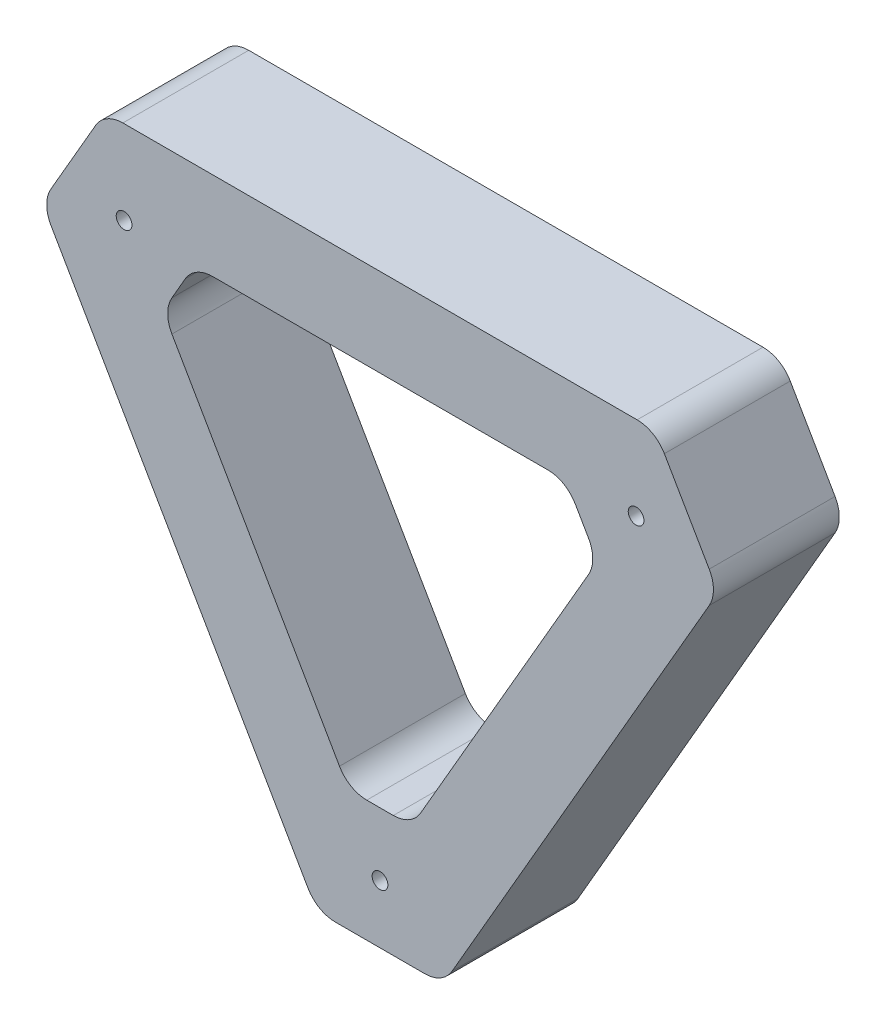
ISO-10303-21;
HEADER;
FILE_DESCRIPTION(('STEP AP214'),'2;1');
FILE_NAME('part.step','',(''),(''),'','','');
FILE_SCHEMA(('AUTOMOTIVE_DESIGN { 1 0 10303 214 1 1 1 1 }'));
ENDSEC;
DATA;
#1=APPLICATION_CONTEXT('core data for automotive mechanical design processes');
#2=APPLICATION_PROTOCOL_DEFINITION('international standard','automotive_design',2000,#1);
#3=PRODUCT_CONTEXT('',#1,'mechanical');
#4=PRODUCT('Part','Part','',(#3));
#5=PRODUCT_RELATED_PRODUCT_CATEGORY('part','',(#4));
#6=PRODUCT_DEFINITION_FORMATION('','',#4);
#7=PRODUCT_DEFINITION_CONTEXT('part definition',#1,'design');
#8=PRODUCT_DEFINITION('design','',#6,#7);
#9=PRODUCT_DEFINITION_SHAPE('','',#8);
#10=(LENGTH_UNIT() NAMED_UNIT(*) SI_UNIT(.MILLI.,.METRE.));
#11=(NAMED_UNIT(*) PLANE_ANGLE_UNIT() SI_UNIT($,.RADIAN.));
#12=(NAMED_UNIT(*) SI_UNIT($,.STERADIAN.) SOLID_ANGLE_UNIT());
#13=UNCERTAINTY_MEASURE_WITH_UNIT(LENGTH_MEASURE(1.E-05),#10,'distance_accuracy_value','');
#14=(GEOMETRIC_REPRESENTATION_CONTEXT(3) GLOBAL_UNCERTAINTY_ASSIGNED_CONTEXT((#13)) GLOBAL_UNIT_ASSIGNED_CONTEXT((#10,
#11,#12)) REPRESENTATION_CONTEXT('',''));
#15=CARTESIAN_POINT('',(0.,0.,0.));
#16=DIRECTION('',(0.,0.,1.));
#17=DIRECTION('',(1.,0.,0.));
#18=AXIS2_PLACEMENT_3D('',#15,#16,#17);
#19=CARTESIAN_POINT('',(71.1053170988695,110.713631436787,20.));
#20=DIRECTION('',(0.,0.,1.));
#21=DIRECTION('',(1.,0.,0.));
#22=AXIS2_PLACEMENT_3D('',#19,#20,#21);
#23=PLANE('',#22);
#24=CARTESIAN_POINT('',(63.9917018959607,114.980441868389,20.));
#25=DIRECTION('',(0.,0.,1.));
#26=DIRECTION('',(1.,0.,0.));
#27=AXIS2_PLACEMENT_3D('',#24,#25,#26);
#28=CIRCLE('',#27,1.25);
#29=CARTESIAN_POINT('',(65.2417018959607,114.980441868389,20.));
#30=VERTEX_POINT('',#29);
#31=EDGE_CURVE('E699',#30,#30,#28,.T.);
#32=ORIENTED_EDGE('',*,*,#31,.F.);
#33=EDGE_LOOP('',(#32));
#34=FACE_BOUND('',#33,.T.);
#35=DIRECTION('',(1.,0.,0.));
#36=VECTOR('',#35,1.);
#37=CARTESIAN_POINT('',(61.8848779374495,124.993254081832,20.));
#38=LINE('',#37,#36);
#39=CARTESIAN_POINT('',(61.8848779374495,124.993254081832,20.));
#40=VERTEX_POINT('',#39);
#41=CARTESIAN_POINT('',(66.1118188221357,124.993254081832,20.));
#42=VERTEX_POINT('',#41);
#43=EDGE_CURVE('E202',#40,#42,#38,.T.);
#44=ORIENTED_EDGE('',*,*,#43,.F.);
#45=CARTESIAN_POINT('',(61.8848779374495,129.993254081832,20.));
#46=DIRECTION('',(0.,0.,1.));
#47=DIRECTION('',(1.,0.,0.));
#48=AXIS2_PLACEMENT_3D('',#45,#46,#47);
#49=CIRCLE('',#48,5.);
#50=CARTESIAN_POINT('',(57.5538812574324,127.494760984447,20.));
#51=VERTEX_POINT('',#50);
#52=EDGE_CURVE('E194',#51,#40,#49,.T.);
#53=ORIENTED_EDGE('',*,*,#52,.F.);
#54=DIRECTION('',(0.499698619476988,-0.866199336003435,0.));
#55=VECTOR('',#54,1.);
#56=CARTESIAN_POINT('',(30.9258291216338,173.652985522339,20.));
#57=LINE('',#56,#55);
#58=CARTESIAN_POINT('',(30.9258291216338,173.652985522339,20.));
#59=VERTEX_POINT('',#58);
#60=EDGE_CURVE('E237',#59,#51,#57,.T.);
#61=ORIENTED_EDGE('',*,*,#60,.F.);
#62=CARTESIAN_POINT('',(35.256825801651,176.151478619724,20.));
#63=DIRECTION('',(0.,0.,1.));
#64=DIRECTION('',(1.,0.,0.));
#65=AXIS2_PLACEMENT_3D('',#62,#63,#64);
#66=CIRCLE('',#65,4.99999999999999);
#67=CARTESIAN_POINT('',(30.9268070179789,178.651666079305,20.));
#68=VERTEX_POINT('',#67);
#69=EDGE_CURVE('E235',#68,#59,#66,.T.);
#70=ORIENTED_EDGE('',*,*,#69,.F.);
#71=DIRECTION('',(-0.500037491916198,-0.866003756734437,0.));
#72=VECTOR('',#71,1.);
#73=CARTESIAN_POINT('',(30.9268070179789,178.651666079305,20.));
#74=LINE('',#73,#72);
#75=CARTESIAN_POINT('',(33.0411886245935,182.313516328736,20.));
#76=VERTEX_POINT('',#75);
#77=EDGE_CURVE('E233',#76,#68,#74,.T.);
#78=ORIENTED_EDGE('',*,*,#77,.F.);
#79=CARTESIAN_POINT('',(37.3712074082656,179.813328869155,20.));
#80=DIRECTION('',(0.,0.,1.));
#81=DIRECTION('',(1.,0.,0.));
#82=AXIS2_PLACEMENT_3D('',#79,#80,#81);
#83=CIRCLE('',#82,4.99999999999998);
#84=CARTESIAN_POINT('',(37.3700237476384,184.81332872905,20.));
#85=VERTEX_POINT('',#84);
#86=EDGE_CURVE('E231',#85,#76,#83,.T.);
#87=ORIENTED_EDGE('',*,*,#86,.F.);
#88=DIRECTION('',(-0.99999997197895,-0.000236732125444427,0.));
#89=VECTOR('',#88,1.);
#90=CARTESIAN_POINT('',(90.6853210420853,184.825950173051,20.));
#91=LINE('',#90,#89);
#92=CARTESIAN_POINT('',(90.6853210420853,184.825950173051,20.));
#93=VERTEX_POINT('',#92);
#94=EDGE_CURVE('E229',#93,#85,#91,.T.);
#95=ORIENTED_EDGE('',*,*,#94,.F.);
#96=CARTESIAN_POINT('',(90.6865047027125,179.825950313156,20.));
#97=DIRECTION('',(0.,0.,1.));
#98=DIRECTION('',(1.,0.,0.));
#99=AXIS2_PLACEMENT_3D('',#96,#97,#98);
#100=CIRCLE('',#99,5.);
#101=CARTESIAN_POINT('',(95.0148219172484,182.329082369272,20.));
#102=VERTEX_POINT('',#101);
#103=EDGE_CURVE('E227',#102,#93,#100,.T.);
#104=ORIENTED_EDGE('',*,*,#103,.F.);
#105=DIRECTION('',(-0.50062641122309,0.865663442907166,0.));
#106=VECTOR('',#105,1.);
#107=CARTESIAN_POINT('',(97.129519323786,178.672431028848,20.));
#108=LINE('',#107,#106);
#109=CARTESIAN_POINT('',(97.129519323786,178.672431028848,20.));
#110=VERTEX_POINT('',#109);
#111=EDGE_CURVE('E225',#110,#102,#108,.T.);
#112=ORIENTED_EDGE('',*,*,#111,.F.);
#113=CARTESIAN_POINT('',(92.8012021092502,176.169298972733,20.));
#114=DIRECTION('',(0.,0.,1.));
#115=DIRECTION('',(1.,0.,0.));
#116=AXIS2_PLACEMENT_3D('',#113,#114,#115);
#117=CIRCLE('',#116,5.);
#118=CARTESIAN_POINT('',(97.130125766881,173.667215847334,20.));
#119=VERTEX_POINT('',#118);
#120=EDGE_CURVE('E223',#119,#110,#117,.T.);
#121=ORIENTED_EDGE('',*,*,#120,.F.);
#122=DIRECTION('',(0.500416625079699,0.865784731526171,0.));
#123=VECTOR('',#122,1.);
#124=CARTESIAN_POINT('',(70.4407424797666,127.491170956433,20.));
#125=LINE('',#124,#123);
#126=CARTESIAN_POINT('',(70.4407424797666,127.491170956433,20.));
#127=VERTEX_POINT('',#126);
#128=EDGE_CURVE('E218',#127,#119,#125,.T.);
#129=ORIENTED_EDGE('',*,*,#128,.F.);
#130=CARTESIAN_POINT('',(66.1118188221357,129.993254081832,20.));
#131=DIRECTION('',(0.,0.,1.));
#132=DIRECTION('',(1.,0.,0.));
#133=AXIS2_PLACEMENT_3D('',#130,#131,#132);
#134=CIRCLE('',#133,5.00000000000001);
#135=EDGE_CURVE('E216',#42,#127,#134,.T.);
#136=ORIENTED_EDGE('',*,*,#135,.F.);
#137=EDGE_LOOP('',(#44,#53,#61,#70,#78,#87,#95,#104,#112,#121,#129,#136));
#138=FACE_BOUND('',#137,.T.);
#139=CARTESIAN_POINT('',(71.1053170988695,110.713631436787,20.));
#140=DIRECTION('',(0.,0.,1.));
#141=DIRECTION('',(1.,0.,0.));
#142=AXIS2_PLACEMENT_3D('',#139,#140,#141);
#143=CIRCLE('',#142,5.00000000000001);
#144=CARTESIAN_POINT('',(71.1053170988695,105.713631436787,20.));
#145=VERTEX_POINT('',#144);
#146=CARTESIAN_POINT('',(75.4351691712407,108.213155275856,20.));
#147=VERTEX_POINT('',#146);
#148=EDGE_CURVE('E290',#145,#147,#143,.T.);
#149=ORIENTED_EDGE('',*,*,#148,.T.);
#150=DIRECTION('',(0.500095232186172,0.865970414474223,0.));
#151=VECTOR('',#150,1.);
#152=CARTESIAN_POINT('',(116.310694096443,178.993664633224,20.));
#153=LINE('',#152,#151);
#154=CARTESIAN_POINT('',(116.310694096443,178.993664633224,20.));
#155=VERTEX_POINT('',#154);
#156=EDGE_CURVE('E293',#147,#155,#153,.T.);
#157=ORIENTED_EDGE('',*,*,#156,.T.);
#158=CARTESIAN_POINT('',(111.980842024072,181.494140794155,20.));
#159=DIRECTION('',(0.,0.,1.));
#160=DIRECTION('',(1.,0.,0.));
#161=AXIS2_PLACEMENT_3D('',#158,#159,#160);
#162=CIRCLE('',#161,5.00000000000001);
#163=CARTESIAN_POINT('',(116.309159238607,183.997272850271,20.));
#164=VERTEX_POINT('',#163);
#165=EDGE_CURVE('E296',#155,#164,#162,.T.);
#166=ORIENTED_EDGE('',*,*,#165,.T.);
#167=DIRECTION('',(-0.500626411223098,0.865663442907162,0.));
#168=VECTOR('',#167,1.);
#169=CARTESIAN_POINT('',(109.183125053638,196.319330074066,20.));
#170=LINE('',#169,#168);
#171=CARTESIAN_POINT('',(109.183125053638,196.319330074066,20.));
#172=VERTEX_POINT('',#171);
#173=EDGE_CURVE('E298',#164,#172,#170,.T.);
#174=ORIENTED_EDGE('',*,*,#173,.T.);
#175=CARTESIAN_POINT('',(104.854807839103,193.816198017951,20.));
#176=DIRECTION('',(0.,0.,1.));
#177=DIRECTION('',(1.,0.,0.));
#178=AXIS2_PLACEMENT_3D('',#175,#176,#177);
#179=CIRCLE('',#178,5.00000000000001);
#180=CARTESIAN_POINT('',(104.854461983556,198.816198005989,20.));
#181=VERTEX_POINT('',#180);
#182=EDGE_CURVE('E300',#172,#181,#179,.T.);
#183=ORIENTED_EDGE('',*,*,#182,.T.);
#184=DIRECTION('',(-0.999999997607679,-6.91711092336887E-05,0.));
#185=VECTOR('',#184,1.);
#186=CARTESIAN_POINT('',(23.1284899273192,198.810544929835,20.));
#187=LINE('',#186,#185);
#188=CARTESIAN_POINT('',(23.1284899273192,198.810544929835,20.));
#189=VERTEX_POINT('',#188);
#190=EDGE_CURVE('E302',#181,#189,#187,.T.);
#191=ORIENTED_EDGE('',*,*,#190,.T.);
#192=CARTESIAN_POINT('',(23.1288357828653,193.810544941797,20.));
#193=DIRECTION('',(0.,0.,1.));
#194=DIRECTION('',(1.,0.,0.));
#195=AXIS2_PLACEMENT_3D('',#192,#193,#194);
#196=CIRCLE('',#195,4.99999999999999);
#197=CARTESIAN_POINT('',(18.7988169991931,196.310732401378,20.));
#198=VERTEX_POINT('',#197);
#199=EDGE_CURVE('E304',#189,#198,#196,.T.);
#200=ORIENTED_EDGE('',*,*,#199,.T.);
#201=DIRECTION('',(-0.500037491916202,-0.866003756734435,0.));
#202=VECTOR('',#201,1.);
#203=CARTESIAN_POINT('',(11.694931393106,184.007671687454,20.));
#204=LINE('',#203,#202);
#205=CARTESIAN_POINT('',(11.694931393106,184.007671687454,20.));
#206=VERTEX_POINT('',#205);
#207=EDGE_CURVE('E306',#198,#206,#204,.T.);
#208=ORIENTED_EDGE('',*,*,#207,.T.);
#209=CARTESIAN_POINT('',(16.0249501767781,181.507484227873,20.));
#210=DIRECTION('',(0.,0.,1.));
#211=DIRECTION('',(1.,0.,0.));
#212=AXIS2_PLACEMENT_3D('',#209,#210,#211);
#213=CIRCLE('',#212,5.);
#214=CARTESIAN_POINT('',(11.6943282575247,179.0083416164,20.));
#215=VERTEX_POINT('',#214);
#216=EDGE_CURVE('E308',#206,#215,#213,.T.);
#217=ORIENTED_EDGE('',*,*,#216,.T.);
#218=DIRECTION('',(0.499828522294675,-0.866124383850681,0.));
#219=VECTOR('',#218,1.);
#220=CARTESIAN_POINT('',(11.6943282575247,179.0083416164,20.));
#221=LINE('',#220,#219);
#222=CARTESIAN_POINT('',(52.5484913406596,108.214488825313,20.));
#223=VERTEX_POINT('',#222);
#224=EDGE_CURVE('E310',#215,#223,#221,.T.);
#225=ORIENTED_EDGE('',*,*,#224,.T.);
#226=CARTESIAN_POINT('',(56.879113259913,110.713631436787,20.));
#227=DIRECTION('',(0.,0.,1.));
#228=DIRECTION('',(1.,0.,0.));
#229=AXIS2_PLACEMENT_3D('',#226,#227,#228);
#230=CIRCLE('',#229,5.);
#231=CARTESIAN_POINT('',(56.879113259913,105.713631436787,20.));
#232=VERTEX_POINT('',#231);
#233=EDGE_CURVE('E312',#223,#232,#230,.T.);
#234=ORIENTED_EDGE('',*,*,#233,.T.);
#235=DIRECTION('',(1.,0.,0.));
#236=VECTOR('',#235,1.);
#237=CARTESIAN_POINT('',(56.879113259913,105.713631436787,20.));
#238=LINE('',#237,#236);
#239=EDGE_CURVE('E314',#232,#145,#238,.T.);
#240=ORIENTED_EDGE('',*,*,#239,.T.);
#241=EDGE_LOOP('',(#149,#157,#166,#174,#183,#191,#200,#208,#217,#225,#234,#240));
#242=FACE_BOUND('',#241,.T.);
#243=CARTESIAN_POINT('',(23.3214584544274,185.485792279862,20.));
#244=DIRECTION('',(0.,0.,1.));
#245=DIRECTION('',(1.,0.,0.));
#246=AXIS2_PLACEMENT_3D('',#243,#244,#245);
#247=CIRCLE('',#246,1.25);
#248=CARTESIAN_POINT('',(24.5714584544274,185.485792279862,20.));
#249=VERTEX_POINT('',#248);
#250=EDGE_CURVE('E240',#249,#249,#247,.T.);
#251=ORIENTED_EDGE('',*,*,#250,.F.);
#252=EDGE_LOOP('',(#251));
#253=FACE_BOUND('',#252,.T.);
#254=CARTESIAN_POINT('',(104.686697162499,185.492130263131,20.));
#255=DIRECTION('',(0.,0.,1.));
#256=DIRECTION('',(1.,0.,0.));
#257=AXIS2_PLACEMENT_3D('',#254,#255,#256);
#258=CIRCLE('',#257,1.25);
#259=CARTESIAN_POINT('',(105.936697162499,185.492130263131,20.));
#260=VERTEX_POINT('',#259);
#261=EDGE_CURVE('E690',#260,#260,#258,.T.);
#262=ORIENTED_EDGE('',*,*,#261,.F.);
#263=EDGE_LOOP('',(#262));
#264=FACE_BOUND('',#263,.T.);
#265=ADVANCED_FACE('F33',(#34,#138,#242,#253,#264),#23,.T.);
#266=CARTESIAN_POINT('',(71.1053170988695,110.713631436787,0.));
#267=DIRECTION('',(0.,0.,1.));
#268=DIRECTION('',(1.,0.,0.));
#269=AXIS2_PLACEMENT_3D('',#266,#267,#268);
#270=PLANE('',#269);
#271=CARTESIAN_POINT('',(71.1053170988695,110.713631436787,0.));
#272=DIRECTION('',(0.,0.,1.));
#273=DIRECTION('',(1.,0.,0.));
#274=AXIS2_PLACEMENT_3D('',#271,#272,#273);
#275=CIRCLE('',#274,5.00000000000001);
#276=CARTESIAN_POINT('',(71.1053170988695,105.713631436787,0.));
#277=VERTEX_POINT('',#276);
#278=CARTESIAN_POINT('',(75.4351691712407,108.213155275856,0.));
#279=VERTEX_POINT('',#278);
#280=EDGE_CURVE('E210',#277,#279,#275,.T.);
#281=ORIENTED_EDGE('',*,*,#280,.F.);
#282=DIRECTION('',(1.,0.,0.));
#283=VECTOR('',#282,1.);
#284=CARTESIAN_POINT('',(56.879113259913,105.713631436787,0.));
#285=LINE('',#284,#283);
#286=CARTESIAN_POINT('',(56.879113259913,105.713631436787,0.));
#287=VERTEX_POINT('',#286);
#288=EDGE_CURVE('E294',#287,#277,#285,.T.);
#289=ORIENTED_EDGE('',*,*,#288,.F.);
#290=CARTESIAN_POINT('',(56.879113259913,110.713631436787,0.));
#291=DIRECTION('',(0.,0.,1.));
#292=DIRECTION('',(1.,0.,0.));
#293=AXIS2_PLACEMENT_3D('',#290,#291,#292);
#294=CIRCLE('',#293,5.);
#295=CARTESIAN_POINT('',(52.5484913406596,108.214488825313,0.));
#296=VERTEX_POINT('',#295);
#297=EDGE_CURVE('E337',#296,#287,#294,.T.);
#298=ORIENTED_EDGE('',*,*,#297,.F.);
#299=DIRECTION('',(0.499828522294675,-0.866124383850681,0.));
#300=VECTOR('',#299,1.);
#301=CARTESIAN_POINT('',(11.6943282575247,179.0083416164,0.));
#302=LINE('',#301,#300);
#303=CARTESIAN_POINT('',(11.6943282575247,179.0083416164,0.));
#304=VERTEX_POINT('',#303);
#305=EDGE_CURVE('E335',#304,#296,#302,.T.);
#306=ORIENTED_EDGE('',*,*,#305,.F.);
#307=CARTESIAN_POINT('',(16.0249501767781,181.507484227873,0.));
#308=DIRECTION('',(0.,0.,1.));
#309=DIRECTION('',(1.,0.,0.));
#310=AXIS2_PLACEMENT_3D('',#307,#308,#309);
#311=CIRCLE('',#310,5.);
#312=CARTESIAN_POINT('',(11.694931393106,184.007671687454,0.));
#313=VERTEX_POINT('',#312);
#314=EDGE_CURVE('E333',#313,#304,#311,.T.);
#315=ORIENTED_EDGE('',*,*,#314,.F.);
#316=DIRECTION('',(-0.500037491916202,-0.866003756734435,0.));
#317=VECTOR('',#316,1.);
#318=CARTESIAN_POINT('',(11.694931393106,184.007671687454,0.));
#319=LINE('',#318,#317);
#320=CARTESIAN_POINT('',(18.7988169991931,196.310732401378,0.));
#321=VERTEX_POINT('',#320);
#322=EDGE_CURVE('E331',#321,#313,#319,.T.);
#323=ORIENTED_EDGE('',*,*,#322,.F.);
#324=CARTESIAN_POINT('',(23.1288357828653,193.810544941797,0.));
#325=DIRECTION('',(0.,0.,1.));
#326=DIRECTION('',(1.,0.,0.));
#327=AXIS2_PLACEMENT_3D('',#324,#325,#326);
#328=CIRCLE('',#327,4.99999999999999);
#329=CARTESIAN_POINT('',(23.1284899273192,198.810544929835,0.));
#330=VERTEX_POINT('',#329);
#331=EDGE_CURVE('E329',#330,#321,#328,.T.);
#332=ORIENTED_EDGE('',*,*,#331,.F.);
#333=DIRECTION('',(-0.999999997607679,-6.91711092336887E-05,0.));
#334=VECTOR('',#333,1.);
#335=CARTESIAN_POINT('',(23.1284899273192,198.810544929835,0.));
#336=LINE('',#335,#334);
#337=CARTESIAN_POINT('',(104.854461983556,198.816198005989,0.));
#338=VERTEX_POINT('',#337);
#339=EDGE_CURVE('E327',#338,#330,#336,.T.);
#340=ORIENTED_EDGE('',*,*,#339,.F.);
#341=CARTESIAN_POINT('',(104.854807839103,193.816198017951,0.));
#342=DIRECTION('',(0.,0.,1.));
#343=DIRECTION('',(1.,0.,0.));
#344=AXIS2_PLACEMENT_3D('',#341,#342,#343);
#345=CIRCLE('',#344,5.00000000000001);
#346=CARTESIAN_POINT('',(109.183125053638,196.319330074066,0.));
#347=VERTEX_POINT('',#346);
#348=EDGE_CURVE('E325',#347,#338,#345,.T.);
#349=ORIENTED_EDGE('',*,*,#348,.F.);
#350=DIRECTION('',(-0.500626411223098,0.865663442907162,0.));
#351=VECTOR('',#350,1.);
#352=CARTESIAN_POINT('',(109.183125053638,196.319330074066,0.));
#353=LINE('',#352,#351);
#354=CARTESIAN_POINT('',(116.309159238607,183.997272850271,0.));
#355=VERTEX_POINT('',#354);
#356=EDGE_CURVE('E323',#355,#347,#353,.T.);
#357=ORIENTED_EDGE('',*,*,#356,.F.);
#358=CARTESIAN_POINT('',(111.980842024072,181.494140794155,0.));
#359=DIRECTION('',(0.,0.,1.));
#360=DIRECTION('',(1.,0.,0.));
#361=AXIS2_PLACEMENT_3D('',#358,#359,#360);
#362=CIRCLE('',#361,5.00000000000001);
#363=CARTESIAN_POINT('',(116.310694096443,178.993664633224,0.));
#364=VERTEX_POINT('',#363);
#365=EDGE_CURVE('E321',#364,#355,#362,.T.);
#366=ORIENTED_EDGE('',*,*,#365,.F.);
#367=DIRECTION('',(0.500095232186172,0.865970414474223,0.));
#368=VECTOR('',#367,1.);
#369=CARTESIAN_POINT('',(116.310694096443,178.993664633224,0.));
#370=LINE('',#369,#368);
#371=EDGE_CURVE('E319',#279,#364,#370,.T.);
#372=ORIENTED_EDGE('',*,*,#371,.F.);
#373=EDGE_LOOP('',(#281,#289,#298,#306,#315,#323,#332,#340,#349,#357,#366,#372));
#374=FACE_BOUND('',#373,.T.);
#375=CARTESIAN_POINT('',(61.8848779374495,129.993254081832,0.));
#376=DIRECTION('',(0.,0.,1.));
#377=DIRECTION('',(1.,0.,0.));
#378=AXIS2_PLACEMENT_3D('',#375,#376,#377);
#379=CIRCLE('',#378,5.);
#380=CARTESIAN_POINT('',(57.5538812574324,127.494760984447,0.));
#381=VERTEX_POINT('',#380);
#382=CARTESIAN_POINT('',(61.8848779374495,124.993254081832,0.));
#383=VERTEX_POINT('',#382);
#384=EDGE_CURVE('E56',#381,#383,#379,.T.);
#385=ORIENTED_EDGE('',*,*,#384,.T.);
#386=DIRECTION('',(1.,0.,0.));
#387=VECTOR('',#386,1.);
#388=CARTESIAN_POINT('',(61.8848779374495,124.993254081832,0.));
#389=LINE('',#388,#387);
#390=CARTESIAN_POINT('',(66.1118188221357,124.993254081832,0.));
#391=VERTEX_POINT('',#390);
#392=EDGE_CURVE('E209',#383,#391,#389,.T.);
#393=ORIENTED_EDGE('',*,*,#392,.T.);
#394=CARTESIAN_POINT('',(66.1118188221357,129.993254081832,0.));
#395=DIRECTION('',(0.,0.,1.));
#396=DIRECTION('',(1.,0.,0.));
#397=AXIS2_PLACEMENT_3D('',#394,#395,#396);
#398=CIRCLE('',#397,5.00000000000001);
#399=CARTESIAN_POINT('',(70.4407424797666,127.491170956433,0.));
#400=VERTEX_POINT('',#399);
#401=EDGE_CURVE('E242',#391,#400,#398,.T.);
#402=ORIENTED_EDGE('',*,*,#401,.T.);
#403=DIRECTION('',(0.500416625079699,0.865784731526171,0.));
#404=VECTOR('',#403,1.);
#405=CARTESIAN_POINT('',(70.4407424797666,127.491170956433,0.));
#406=LINE('',#405,#404);
#407=CARTESIAN_POINT('',(97.130125766881,173.667215847334,0.));
#408=VERTEX_POINT('',#407);
#409=EDGE_CURVE('E245',#400,#408,#406,.T.);
#410=ORIENTED_EDGE('',*,*,#409,.T.);
#411=CARTESIAN_POINT('',(92.8012021092502,176.169298972733,0.));
#412=DIRECTION('',(0.,0.,1.));
#413=DIRECTION('',(1.,0.,0.));
#414=AXIS2_PLACEMENT_3D('',#411,#412,#413);
#415=CIRCLE('',#414,5.);
#416=CARTESIAN_POINT('',(97.129519323786,178.672431028848,0.));
#417=VERTEX_POINT('',#416);
#418=EDGE_CURVE('E248',#408,#417,#415,.T.);
#419=ORIENTED_EDGE('',*,*,#418,.T.);
#420=DIRECTION('',(-0.50062641122309,0.865663442907166,0.));
#421=VECTOR('',#420,1.);
#422=CARTESIAN_POINT('',(97.129519323786,178.672431028848,0.));
#423=LINE('',#422,#421);
#424=CARTESIAN_POINT('',(95.0148219172484,182.329082369272,0.));
#425=VERTEX_POINT('',#424);
#426=EDGE_CURVE('E251',#417,#425,#423,.T.);
#427=ORIENTED_EDGE('',*,*,#426,.T.);
#428=CARTESIAN_POINT('',(90.6865047027125,179.825950313156,0.));
#429=DIRECTION('',(0.,0.,1.));
#430=DIRECTION('',(1.,0.,0.));
#431=AXIS2_PLACEMENT_3D('',#428,#429,#430);
#432=CIRCLE('',#431,5.);
#433=CARTESIAN_POINT('',(90.6853210420853,184.825950173051,0.));
#434=VERTEX_POINT('',#433);
#435=EDGE_CURVE('E254',#425,#434,#432,.T.);
#436=ORIENTED_EDGE('',*,*,#435,.T.);
#437=DIRECTION('',(-0.99999997197895,-0.000236732125444427,0.));
#438=VECTOR('',#437,1.);
#439=CARTESIAN_POINT('',(90.6853210420853,184.825950173051,0.));
#440=LINE('',#439,#438);
#441=CARTESIAN_POINT('',(37.3700237476384,184.81332872905,0.));
#442=VERTEX_POINT('',#441);
#443=EDGE_CURVE('E257',#434,#442,#440,.T.);
#444=ORIENTED_EDGE('',*,*,#443,.T.);
#445=CARTESIAN_POINT('',(37.3712074082656,179.813328869155,0.));
#446=DIRECTION('',(0.,0.,1.));
#447=DIRECTION('',(1.,0.,0.));
#448=AXIS2_PLACEMENT_3D('',#445,#446,#447);
#449=CIRCLE('',#448,4.99999999999998);
#450=CARTESIAN_POINT('',(33.0411886245935,182.313516328736,0.));
#451=VERTEX_POINT('',#450);
#452=EDGE_CURVE('E260',#442,#451,#449,.T.);
#453=ORIENTED_EDGE('',*,*,#452,.T.);
#454=DIRECTION('',(-0.500037491916198,-0.866003756734437,0.));
#455=VECTOR('',#454,1.);
#456=CARTESIAN_POINT('',(30.9268070179789,178.651666079305,0.));
#457=LINE('',#456,#455);
#458=CARTESIAN_POINT('',(30.9268070179789,178.651666079305,0.));
#459=VERTEX_POINT('',#458);
#460=EDGE_CURVE('E263',#451,#459,#457,.T.);
#461=ORIENTED_EDGE('',*,*,#460,.T.);
#462=CARTESIAN_POINT('',(35.256825801651,176.151478619724,0.));
#463=DIRECTION('',(0.,0.,1.));
#464=DIRECTION('',(1.,0.,0.));
#465=AXIS2_PLACEMENT_3D('',#462,#463,#464);
#466=CIRCLE('',#465,4.99999999999999);
#467=CARTESIAN_POINT('',(30.9258291216338,173.652985522339,0.));
#468=VERTEX_POINT('',#467);
#469=EDGE_CURVE('E266',#459,#468,#466,.T.);
#470=ORIENTED_EDGE('',*,*,#469,.T.);
#471=DIRECTION('',(0.499698619476988,-0.866199336003435,0.));
#472=VECTOR('',#471,1.);
#473=CARTESIAN_POINT('',(30.9258291216338,173.652985522339,0.));
#474=LINE('',#473,#472);
#475=EDGE_CURVE('E203',#468,#381,#474,.T.);
#476=ORIENTED_EDGE('',*,*,#475,.T.);
#477=EDGE_LOOP('',(#385,#393,#402,#410,#419,#427,#436,#444,#453,#461,#470,#476));
#478=FACE_BOUND('',#477,.T.);
#479=CARTESIAN_POINT('',(23.3214584544274,185.485792279862,0.));
#480=DIRECTION('',(0.,0.,1.));
#481=DIRECTION('',(1.,0.,0.));
#482=AXIS2_PLACEMENT_3D('',#479,#480,#481);
#483=CIRCLE('',#482,1.25);
#484=CARTESIAN_POINT('',(24.5714584544274,185.485792279862,0.));
#485=VERTEX_POINT('',#484);
#486=EDGE_CURVE('E702',#485,#485,#483,.T.);
#487=ORIENTED_EDGE('',*,*,#486,.T.);
#488=EDGE_LOOP('',(#487));
#489=FACE_BOUND('',#488,.T.);
#490=CARTESIAN_POINT('',(63.9917018959607,114.980441868389,0.));
#491=DIRECTION('',(0.,0.,1.));
#492=DIRECTION('',(1.,0.,0.));
#493=AXIS2_PLACEMENT_3D('',#490,#491,#492);
#494=CIRCLE('',#493,1.25);
#495=CARTESIAN_POINT('',(65.2417018959607,114.980441868389,0.));
#496=VERTEX_POINT('',#495);
#497=EDGE_CURVE('E696',#496,#496,#494,.T.);
#498=ORIENTED_EDGE('',*,*,#497,.T.);
#499=EDGE_LOOP('',(#498));
#500=FACE_BOUND('',#499,.T.);
#501=CARTESIAN_POINT('',(104.686697162499,185.492130263131,0.));
#502=DIRECTION('',(0.,0.,1.));
#503=DIRECTION('',(1.,0.,0.));
#504=AXIS2_PLACEMENT_3D('',#501,#502,#503);
#505=CIRCLE('',#504,1.25);
#506=CARTESIAN_POINT('',(105.936697162499,185.492130263131,0.));
#507=VERTEX_POINT('',#506);
#508=EDGE_CURVE('E693',#507,#507,#505,.T.);
#509=ORIENTED_EDGE('',*,*,#508,.T.);
#510=EDGE_LOOP('',(#509));
#511=FACE_BOUND('',#510,.T.);
#512=ADVANCED_FACE('F379',(#374,#478,#489,#500,#511),#270,.F.);
#513=CARTESIAN_POINT('',(71.1053170988695,110.713631436787,20.));
#514=DIRECTION('',(0.,0.,-1.));
#515=DIRECTION('',(-1.,0.,0.));
#516=AXIS2_PLACEMENT_3D('',#513,#514,#515);
#517=CYLINDRICAL_SURFACE('',#516,5.00000000000001);
#518=ORIENTED_EDGE('',*,*,#280,.T.);
#519=DIRECTION('',(0.,0.,-1.));
#520=VECTOR('',#519,1.);
#521=CARTESIAN_POINT('',(75.4351691712407,108.213155275856,20.));
#522=LINE('',#521,#520);
#523=EDGE_CURVE('E11',#147,#279,#522,.T.);
#524=ORIENTED_EDGE('',*,*,#523,.F.);
#525=ORIENTED_EDGE('',*,*,#148,.F.);
#526=DIRECTION('',(0.,0.,-1.));
#527=VECTOR('',#526,1.);
#528=CARTESIAN_POINT('',(71.1053170988695,105.713631436787,20.));
#529=LINE('',#528,#527);
#530=EDGE_CURVE('E316',#145,#277,#529,.T.);
#531=ORIENTED_EDGE('',*,*,#530,.T.);
#532=EDGE_LOOP('',(#518,#524,#525,#531));
#533=FACE_BOUND('',#532,.T.);
#534=ADVANCED_FACE('F35',(#533),#517,.T.);
#535=CARTESIAN_POINT('',(116.310694096443,178.993664633224,20.));
#536=DIRECTION('',(-0.865970414474223,0.500095232186172,0.));
#537=DIRECTION('',(-0.500095232186172,-0.865970414474223,0.));
#538=AXIS2_PLACEMENT_3D('',#535,#536,#537);
#539=PLANE('',#538);
#540=ORIENTED_EDGE('',*,*,#371,.T.);
#541=DIRECTION('',(0.,0.,-1.));
#542=VECTOR('',#541,1.);
#543=CARTESIAN_POINT('',(116.310694096443,178.993664633224,20.));
#544=LINE('',#543,#542);
#545=EDGE_CURVE('E41',#155,#364,#544,.T.);
#546=ORIENTED_EDGE('',*,*,#545,.F.);
#547=ORIENTED_EDGE('',*,*,#156,.F.);
#548=ORIENTED_EDGE('',*,*,#523,.T.);
#549=EDGE_LOOP('',(#540,#546,#547,#548));
#550=FACE_BOUND('',#549,.T.);
#551=ADVANCED_FACE('F396',(#550),#539,.F.);
#552=CARTESIAN_POINT('',(111.980842024072,181.494140794155,20.));
#553=DIRECTION('',(0.,0.,-1.));
#554=DIRECTION('',(-1.,0.,0.));
#555=AXIS2_PLACEMENT_3D('',#552,#553,#554);
#556=CYLINDRICAL_SURFACE('',#555,5.00000000000001);
#557=ORIENTED_EDGE('',*,*,#365,.T.);
#558=DIRECTION('',(0.,0.,-1.));
#559=VECTOR('',#558,1.);
#560=CARTESIAN_POINT('',(116.309159238607,183.997272850271,20.));
#561=LINE('',#560,#559);
#562=EDGE_CURVE('E366',#164,#355,#561,.T.);
#563=ORIENTED_EDGE('',*,*,#562,.F.);
#564=ORIENTED_EDGE('',*,*,#165,.F.);
#565=ORIENTED_EDGE('',*,*,#545,.T.);
#566=EDGE_LOOP('',(#557,#563,#564,#565));
#567=FACE_BOUND('',#566,.T.);
#568=ADVANCED_FACE('F373',(#567),#556,.T.);
#569=CARTESIAN_POINT('',(109.183125053638,196.319330074066,20.));
#570=DIRECTION('',(-0.865663442907162,-0.500626411223098,0.));
#571=DIRECTION('',(0.500626411223098,-0.865663442907162,0.));
#572=AXIS2_PLACEMENT_3D('',#569,#570,#571);
#573=PLANE('',#572);
#574=ORIENTED_EDGE('',*,*,#356,.T.);
#575=DIRECTION('',(0.,0.,-1.));
#576=VECTOR('',#575,1.);
#577=CARTESIAN_POINT('',(109.183125053638,196.319330074066,20.));
#578=LINE('',#577,#576);
#579=EDGE_CURVE('E363',#172,#347,#578,.T.);
#580=ORIENTED_EDGE('',*,*,#579,.F.);
#581=ORIENTED_EDGE('',*,*,#173,.F.);
#582=ORIENTED_EDGE('',*,*,#562,.T.);
#583=EDGE_LOOP('',(#574,#580,#581,#582));
#584=FACE_BOUND('',#583,.T.);
#585=ADVANCED_FACE('F385',(#584),#573,.F.);
#586=CARTESIAN_POINT('',(104.854807839103,193.816198017951,20.));
#587=DIRECTION('',(0.,0.,-1.));
#588=DIRECTION('',(-1.,0.,0.));
#589=AXIS2_PLACEMENT_3D('',#586,#587,#588);
#590=CYLINDRICAL_SURFACE('',#589,5.00000000000001);
#591=ORIENTED_EDGE('',*,*,#348,.T.);
#592=DIRECTION('',(0.,0.,-1.));
#593=VECTOR('',#592,1.);
#594=CARTESIAN_POINT('',(104.854461983556,198.816198005989,20.));
#595=LINE('',#594,#593);
#596=EDGE_CURVE('E360',#181,#338,#595,.T.);
#597=ORIENTED_EDGE('',*,*,#596,.F.);
#598=ORIENTED_EDGE('',*,*,#182,.F.);
#599=ORIENTED_EDGE('',*,*,#579,.T.);
#600=EDGE_LOOP('',(#591,#597,#598,#599));
#601=FACE_BOUND('',#600,.T.);
#602=ADVANCED_FACE('F389',(#601),#590,.T.);
#603=CARTESIAN_POINT('',(23.1284899273192,198.810544929835,20.));
#604=DIRECTION('',(6.91711092336887E-05,-0.999999997607679,0.));
#605=DIRECTION('',(0.999999997607679,6.91711092336887E-05,0.));
#606=AXIS2_PLACEMENT_3D('',#603,#604,#605);
#607=PLANE('',#606);
#608=ORIENTED_EDGE('',*,*,#339,.T.);
#609=DIRECTION('',(0.,0.,-1.));
#610=VECTOR('',#609,1.);
#611=CARTESIAN_POINT('',(23.1284899273192,198.810544929835,20.));
#612=LINE('',#611,#610);
#613=EDGE_CURVE('E357',#189,#330,#612,.T.);
#614=ORIENTED_EDGE('',*,*,#613,.F.);
#615=ORIENTED_EDGE('',*,*,#190,.F.);
#616=ORIENTED_EDGE('',*,*,#596,.T.);
#617=EDGE_LOOP('',(#608,#614,#615,#616));
#618=FACE_BOUND('',#617,.T.);
#619=ADVANCED_FACE('F429',(#618),#607,.F.);
#620=CARTESIAN_POINT('',(23.1288357828653,193.810544941797,20.));
#621=DIRECTION('',(0.,0.,-1.));
#622=DIRECTION('',(-1.,0.,0.));
#623=AXIS2_PLACEMENT_3D('',#620,#621,#622);
#624=CYLINDRICAL_SURFACE('',#623,4.99999999999999);
#625=ORIENTED_EDGE('',*,*,#331,.T.);
#626=DIRECTION('',(0.,0.,-1.));
#627=VECTOR('',#626,1.);
#628=CARTESIAN_POINT('',(18.7988169991931,196.310732401378,20.));
#629=LINE('',#628,#627);
#630=EDGE_CURVE('E354',#198,#321,#629,.T.);
#631=ORIENTED_EDGE('',*,*,#630,.F.);
#632=ORIENTED_EDGE('',*,*,#199,.F.);
#633=ORIENTED_EDGE('',*,*,#613,.T.);
#634=EDGE_LOOP('',(#625,#631,#632,#633));
#635=FACE_BOUND('',#634,.T.);
#636=ADVANCED_FACE('F427',(#635),#624,.T.);
#637=CARTESIAN_POINT('',(11.694931393106,184.007671687454,20.));
#638=DIRECTION('',(0.866003756734435,-0.500037491916202,0.));
#639=DIRECTION('',(0.500037491916202,0.866003756734435,0.));
#640=AXIS2_PLACEMENT_3D('',#637,#638,#639);
#641=PLANE('',#640);
#642=ORIENTED_EDGE('',*,*,#322,.T.);
#643=DIRECTION('',(0.,0.,-1.));
#644=VECTOR('',#643,1.);
#645=CARTESIAN_POINT('',(11.694931393106,184.007671687454,20.));
#646=LINE('',#645,#644);
#647=EDGE_CURVE('E351',#206,#313,#646,.T.);
#648=ORIENTED_EDGE('',*,*,#647,.F.);
#649=ORIENTED_EDGE('',*,*,#207,.F.);
#650=ORIENTED_EDGE('',*,*,#630,.T.);
#651=EDGE_LOOP('',(#642,#648,#649,#650));
#652=FACE_BOUND('',#651,.T.);
#653=ADVANCED_FACE('F423',(#652),#641,.F.);
#654=CARTESIAN_POINT('',(16.0249501767781,181.507484227873,20.));
#655=DIRECTION('',(0.,0.,-1.));
#656=DIRECTION('',(-1.,0.,0.));
#657=AXIS2_PLACEMENT_3D('',#654,#655,#656);
#658=CYLINDRICAL_SURFACE('',#657,5.);
#659=ORIENTED_EDGE('',*,*,#314,.T.);
#660=DIRECTION('',(0.,0.,-1.));
#661=VECTOR('',#660,1.);
#662=CARTESIAN_POINT('',(11.6943282575247,179.0083416164,20.));
#663=LINE('',#662,#661);
#664=EDGE_CURVE('E348',#215,#304,#663,.T.);
#665=ORIENTED_EDGE('',*,*,#664,.F.);
#666=ORIENTED_EDGE('',*,*,#216,.F.);
#667=ORIENTED_EDGE('',*,*,#647,.T.);
#668=EDGE_LOOP('',(#659,#665,#666,#667));
#669=FACE_BOUND('',#668,.T.);
#670=ADVANCED_FACE('F418',(#669),#658,.T.);
#671=CARTESIAN_POINT('',(11.6943282575247,179.0083416164,20.));
#672=DIRECTION('',(0.866124383850681,0.499828522294675,0.));
#673=DIRECTION('',(-0.499828522294675,0.866124383850681,0.));
#674=AXIS2_PLACEMENT_3D('',#671,#672,#673);
#675=PLANE('',#674);
#676=ORIENTED_EDGE('',*,*,#305,.T.);
#677=DIRECTION('',(0.,0.,-1.));
#678=VECTOR('',#677,1.);
#679=CARTESIAN_POINT('',(52.5484913406596,108.214488825313,20.));
#680=LINE('',#679,#678);
#681=EDGE_CURVE('E345',#223,#296,#680,.T.);
#682=ORIENTED_EDGE('',*,*,#681,.F.);
#683=ORIENTED_EDGE('',*,*,#224,.F.);
#684=ORIENTED_EDGE('',*,*,#664,.T.);
#685=EDGE_LOOP('',(#676,#682,#683,#684));
#686=FACE_BOUND('',#685,.T.);
#687=ADVANCED_FACE('F412',(#686),#675,.F.);
#688=CARTESIAN_POINT('',(56.879113259913,110.713631436787,20.));
#689=DIRECTION('',(0.,0.,-1.));
#690=DIRECTION('',(-1.,0.,0.));
#691=AXIS2_PLACEMENT_3D('',#688,#689,#690);
#692=CYLINDRICAL_SURFACE('',#691,5.);
#693=ORIENTED_EDGE('',*,*,#297,.T.);
#694=DIRECTION('',(0.,0.,-1.));
#695=VECTOR('',#694,1.);
#696=CARTESIAN_POINT('',(56.879113259913,105.713631436787,20.));
#697=LINE('',#696,#695);
#698=EDGE_CURVE('E342',#232,#287,#697,.T.);
#699=ORIENTED_EDGE('',*,*,#698,.F.);
#700=ORIENTED_EDGE('',*,*,#233,.F.);
#701=ORIENTED_EDGE('',*,*,#681,.T.);
#702=EDGE_LOOP('',(#693,#699,#700,#701));
#703=FACE_BOUND('',#702,.T.);
#704=ADVANCED_FACE('F408',(#703),#692,.T.);
#705=CARTESIAN_POINT('',(56.879113259913,105.713631436787,20.));
#706=DIRECTION('',(0.,1.,0.));
#707=DIRECTION('',(0.,0.,1.));
#708=AXIS2_PLACEMENT_3D('',#705,#706,#707);
#709=PLANE('',#708);
#710=ORIENTED_EDGE('',*,*,#288,.T.);
#711=ORIENTED_EDGE('',*,*,#530,.F.);
#712=ORIENTED_EDGE('',*,*,#239,.F.);
#713=ORIENTED_EDGE('',*,*,#698,.T.);
#714=EDGE_LOOP('',(#710,#711,#712,#713));
#715=FACE_BOUND('',#714,.T.);
#716=ADVANCED_FACE('F403',(#715),#709,.F.);
#717=CARTESIAN_POINT('',(61.8848779374495,129.993254081832,20.));
#718=DIRECTION('',(0.,0.,-1.));
#719=DIRECTION('',(-1.,0.,0.));
#720=AXIS2_PLACEMENT_3D('',#717,#718,#719);
#721=CYLINDRICAL_SURFACE('',#720,5.);
#722=ORIENTED_EDGE('',*,*,#384,.F.);
#723=DIRECTION('',(0.,0.,-1.));
#724=VECTOR('',#723,1.);
#725=CARTESIAN_POINT('',(57.5538812574324,127.494760984447,20.));
#726=LINE('',#725,#724);
#727=EDGE_CURVE('E198',#51,#381,#726,.T.);
#728=ORIENTED_EDGE('',*,*,#727,.F.);
#729=ORIENTED_EDGE('',*,*,#52,.T.);
#730=DIRECTION('',(0.,0.,-1.));
#731=VECTOR('',#730,1.);
#732=CARTESIAN_POINT('',(61.8848779374495,124.993254081832,20.));
#733=LINE('',#732,#731);
#734=EDGE_CURVE('E197',#40,#383,#733,.T.);
#735=ORIENTED_EDGE('',*,*,#734,.T.);
#736=EDGE_LOOP('',(#722,#728,#729,#735));
#737=FACE_BOUND('',#736,.T.);
#738=ADVANCED_FACE('F196',(#737),#721,.F.);
#739=CARTESIAN_POINT('',(61.8848779374495,124.993254081832,20.));
#740=DIRECTION('',(0.,1.,0.));
#741=DIRECTION('',(0.,0.,1.));
#742=AXIS2_PLACEMENT_3D('',#739,#740,#741);
#743=PLANE('',#742);
#744=ORIENTED_EDGE('',*,*,#392,.F.);
#745=ORIENTED_EDGE('',*,*,#734,.F.);
#746=ORIENTED_EDGE('',*,*,#43,.T.);
#747=DIRECTION('',(0.,0.,-1.));
#748=VECTOR('',#747,1.);
#749=CARTESIAN_POINT('',(66.1118188221357,124.993254081832,20.));
#750=LINE('',#749,#748);
#751=EDGE_CURVE('E211',#42,#391,#750,.T.);
#752=ORIENTED_EDGE('',*,*,#751,.T.);
#753=EDGE_LOOP('',(#744,#745,#746,#752));
#754=FACE_BOUND('',#753,.T.);
#755=ADVANCED_FACE('F206',(#754),#743,.T.);
#756=CARTESIAN_POINT('',(66.1118188221357,129.993254081832,20.));
#757=DIRECTION('',(0.,0.,-1.));
#758=DIRECTION('',(-1.,0.,0.));
#759=AXIS2_PLACEMENT_3D('',#756,#757,#758);
#760=CYLINDRICAL_SURFACE('',#759,5.00000000000001);
#761=ORIENTED_EDGE('',*,*,#401,.F.);
#762=ORIENTED_EDGE('',*,*,#751,.F.);
#763=ORIENTED_EDGE('',*,*,#135,.T.);
#764=DIRECTION('',(0.,0.,-1.));
#765=VECTOR('',#764,1.);
#766=CARTESIAN_POINT('',(70.4407424797666,127.491170956433,20.));
#767=LINE('',#766,#765);
#768=EDGE_CURVE('E287',#127,#400,#767,.T.);
#769=ORIENTED_EDGE('',*,*,#768,.T.);
#770=EDGE_LOOP('',(#761,#762,#763,#769));
#771=FACE_BOUND('',#770,.T.);
#772=ADVANCED_FACE('F489',(#771),#760,.F.);
#773=CARTESIAN_POINT('',(70.4407424797666,127.491170956433,20.));
#774=DIRECTION('',(-0.865784731526171,0.500416625079699,0.));
#775=DIRECTION('',(-0.500416625079699,-0.865784731526171,0.));
#776=AXIS2_PLACEMENT_3D('',#773,#774,#775);
#777=PLANE('',#776);
#778=ORIENTED_EDGE('',*,*,#409,.F.);
#779=ORIENTED_EDGE('',*,*,#768,.F.);
#780=ORIENTED_EDGE('',*,*,#128,.T.);
#781=DIRECTION('',(0.,0.,-1.));
#782=VECTOR('',#781,1.);
#783=CARTESIAN_POINT('',(97.130125766881,173.667215847334,20.));
#784=LINE('',#783,#782);
#785=EDGE_CURVE('E285',#119,#408,#784,.T.);
#786=ORIENTED_EDGE('',*,*,#785,.T.);
#787=EDGE_LOOP('',(#778,#779,#780,#786));
#788=FACE_BOUND('',#787,.T.);
#789=ADVANCED_FACE('F495',(#788),#777,.T.);
#790=CARTESIAN_POINT('',(92.8012021092502,176.169298972733,20.));
#791=DIRECTION('',(0.,0.,-1.));
#792=DIRECTION('',(-1.,0.,0.));
#793=AXIS2_PLACEMENT_3D('',#790,#791,#792);
#794=CYLINDRICAL_SURFACE('',#793,5.);
#795=ORIENTED_EDGE('',*,*,#418,.F.);
#796=ORIENTED_EDGE('',*,*,#785,.F.);
#797=ORIENTED_EDGE('',*,*,#120,.T.);
#798=DIRECTION('',(0.,0.,-1.));
#799=VECTOR('',#798,1.);
#800=CARTESIAN_POINT('',(97.129519323786,178.672431028848,20.));
#801=LINE('',#800,#799);
#802=EDGE_CURVE('E283',#110,#417,#801,.T.);
#803=ORIENTED_EDGE('',*,*,#802,.T.);
#804=EDGE_LOOP('',(#795,#796,#797,#803));
#805=FACE_BOUND('',#804,.T.);
#806=ADVANCED_FACE('F503',(#805),#794,.F.);
#807=CARTESIAN_POINT('',(97.129519323786,178.672431028848,20.));
#808=DIRECTION('',(-0.865663442907167,-0.50062641122309,0.));
#809=DIRECTION('',(0.50062641122309,-0.865663442907167,0.));
#810=AXIS2_PLACEMENT_3D('',#807,#808,#809);
#811=PLANE('',#810);
#812=ORIENTED_EDGE('',*,*,#426,.F.);
#813=ORIENTED_EDGE('',*,*,#802,.F.);
#814=ORIENTED_EDGE('',*,*,#111,.T.);
#815=DIRECTION('',(0.,0.,-1.));
#816=VECTOR('',#815,1.);
#817=CARTESIAN_POINT('',(95.0148219172484,182.329082369272,20.));
#818=LINE('',#817,#816);
#819=EDGE_CURVE('E281',#102,#425,#818,.T.);
#820=ORIENTED_EDGE('',*,*,#819,.T.);
#821=EDGE_LOOP('',(#812,#813,#814,#820));
#822=FACE_BOUND('',#821,.T.);
#823=ADVANCED_FACE('F511',(#822),#811,.T.);
#824=CARTESIAN_POINT('',(90.6865047027125,179.825950313156,20.));
#825=DIRECTION('',(0.,0.,-1.));
#826=DIRECTION('',(-1.,0.,0.));
#827=AXIS2_PLACEMENT_3D('',#824,#825,#826);
#828=CYLINDRICAL_SURFACE('',#827,5.);
#829=ORIENTED_EDGE('',*,*,#435,.F.);
#830=ORIENTED_EDGE('',*,*,#819,.F.);
#831=ORIENTED_EDGE('',*,*,#103,.T.);
#832=DIRECTION('',(0.,0.,-1.));
#833=VECTOR('',#832,1.);
#834=CARTESIAN_POINT('',(90.6853210420853,184.825950173051,20.));
#835=LINE('',#834,#833);
#836=EDGE_CURVE('E279',#93,#434,#835,.T.);
#837=ORIENTED_EDGE('',*,*,#836,.T.);
#838=EDGE_LOOP('',(#829,#830,#831,#837));
#839=FACE_BOUND('',#838,.T.);
#840=ADVANCED_FACE('F519',(#839),#828,.F.);
#841=CARTESIAN_POINT('',(90.6853210420853,184.825950173051,20.));
#842=DIRECTION('',(0.000236732125444427,-0.99999997197895,0.));
#843=DIRECTION('',(0.99999997197895,0.000236732125444427,0.));
#844=AXIS2_PLACEMENT_3D('',#841,#842,#843);
#845=PLANE('',#844);
#846=ORIENTED_EDGE('',*,*,#443,.F.);
#847=ORIENTED_EDGE('',*,*,#836,.F.);
#848=ORIENTED_EDGE('',*,*,#94,.T.);
#849=DIRECTION('',(0.,0.,-1.));
#850=VECTOR('',#849,1.);
#851=CARTESIAN_POINT('',(37.3700237476384,184.81332872905,20.));
#852=LINE('',#851,#850);
#853=EDGE_CURVE('E277',#85,#442,#852,.T.);
#854=ORIENTED_EDGE('',*,*,#853,.T.);
#855=EDGE_LOOP('',(#846,#847,#848,#854));
#856=FACE_BOUND('',#855,.T.);
#857=ADVANCED_FACE('F527',(#856),#845,.T.);
#858=CARTESIAN_POINT('',(37.3712074082656,179.813328869155,20.));
#859=DIRECTION('',(0.,0.,-1.));
#860=DIRECTION('',(-1.,0.,0.));
#861=AXIS2_PLACEMENT_3D('',#858,#859,#860);
#862=CYLINDRICAL_SURFACE('',#861,4.99999999999998);
#863=ORIENTED_EDGE('',*,*,#452,.F.);
#864=ORIENTED_EDGE('',*,*,#853,.F.);
#865=ORIENTED_EDGE('',*,*,#86,.T.);
#866=DIRECTION('',(0.,0.,-1.));
#867=VECTOR('',#866,1.);
#868=CARTESIAN_POINT('',(33.0411886245935,182.313516328736,20.));
#869=LINE('',#868,#867);
#870=EDGE_CURVE('E275',#76,#451,#869,.T.);
#871=ORIENTED_EDGE('',*,*,#870,.T.);
#872=EDGE_LOOP('',(#863,#864,#865,#871));
#873=FACE_BOUND('',#872,.T.);
#874=ADVANCED_FACE('F535',(#873),#862,.F.);
#875=CARTESIAN_POINT('',(30.9268070179789,178.651666079305,20.));
#876=DIRECTION('',(0.866003756734437,-0.500037491916198,0.));
#877=DIRECTION('',(0.500037491916198,0.866003756734437,0.));
#878=AXIS2_PLACEMENT_3D('',#875,#876,#877);
#879=PLANE('',#878);
#880=ORIENTED_EDGE('',*,*,#460,.F.);
#881=ORIENTED_EDGE('',*,*,#870,.F.);
#882=ORIENTED_EDGE('',*,*,#77,.T.);
#883=DIRECTION('',(0.,0.,-1.));
#884=VECTOR('',#883,1.);
#885=CARTESIAN_POINT('',(30.9268070179789,178.651666079305,20.));
#886=LINE('',#885,#884);
#887=EDGE_CURVE('E273',#68,#459,#886,.T.);
#888=ORIENTED_EDGE('',*,*,#887,.T.);
#889=EDGE_LOOP('',(#880,#881,#882,#888));
#890=FACE_BOUND('',#889,.T.);
#891=ADVANCED_FACE('F543',(#890),#879,.T.);
#892=CARTESIAN_POINT('',(35.256825801651,176.151478619724,20.));
#893=DIRECTION('',(0.,0.,-1.));
#894=DIRECTION('',(-1.,0.,0.));
#895=AXIS2_PLACEMENT_3D('',#892,#893,#894);
#896=CYLINDRICAL_SURFACE('',#895,4.99999999999999);
#897=ORIENTED_EDGE('',*,*,#469,.F.);
#898=ORIENTED_EDGE('',*,*,#887,.F.);
#899=ORIENTED_EDGE('',*,*,#69,.T.);
#900=DIRECTION('',(0.,0.,-1.));
#901=VECTOR('',#900,1.);
#902=CARTESIAN_POINT('',(30.9258291216338,173.652985522339,20.));
#903=LINE('',#902,#901);
#904=EDGE_CURVE('E48',#59,#468,#903,.T.);
#905=ORIENTED_EDGE('',*,*,#904,.T.);
#906=EDGE_LOOP('',(#897,#898,#899,#905));
#907=FACE_BOUND('',#906,.T.);
#908=ADVANCED_FACE('F551',(#907),#896,.F.);
#909=CARTESIAN_POINT('',(30.9258291216338,173.652985522339,20.));
#910=DIRECTION('',(0.866199336003435,0.499698619476988,0.));
#911=DIRECTION('',(-0.499698619476988,0.866199336003435,0.));
#912=AXIS2_PLACEMENT_3D('',#909,#910,#911);
#913=PLANE('',#912);
#914=ORIENTED_EDGE('',*,*,#475,.F.);
#915=ORIENTED_EDGE('',*,*,#904,.F.);
#916=ORIENTED_EDGE('',*,*,#60,.T.);
#917=ORIENTED_EDGE('',*,*,#727,.T.);
#918=EDGE_LOOP('',(#914,#915,#916,#917));
#919=FACE_BOUND('',#918,.T.);
#920=ADVANCED_FACE('F559',(#919),#913,.T.);
#921=CARTESIAN_POINT('',(23.3214584544274,185.485792279862,20.));
#922=DIRECTION('',(0.,0.,-1.));
#923=DIRECTION('',(-1.,0.,0.));
#924=AXIS2_PLACEMENT_3D('',#921,#922,#923);
#925=CYLINDRICAL_SURFACE('',#924,1.25);
#926=ORIENTED_EDGE('',*,*,#250,.T.);
#927=EDGE_LOOP('',(#926));
#928=FACE_BOUND('',#927,.T.);
#929=ORIENTED_EDGE('',*,*,#486,.F.);
#930=EDGE_LOOP('',(#929));
#931=FACE_BOUND('',#930,.T.);
#932=ADVANCED_FACE('F567',(#928,#931),#925,.F.);
#933=CARTESIAN_POINT('',(63.9917018959607,114.980441868389,20.));
#934=DIRECTION('',(0.,0.,-1.));
#935=DIRECTION('',(-1.,0.,0.));
#936=AXIS2_PLACEMENT_3D('',#933,#934,#935);
#937=CYLINDRICAL_SURFACE('',#936,1.25);
#938=ORIENTED_EDGE('',*,*,#31,.T.);
#939=EDGE_LOOP('',(#938));
#940=FACE_BOUND('',#939,.T.);
#941=ORIENTED_EDGE('',*,*,#497,.F.);
#942=EDGE_LOOP('',(#941));
#943=FACE_BOUND('',#942,.T.);
#944=ADVANCED_FACE('F574',(#940,#943),#937,.F.);
#945=CARTESIAN_POINT('',(104.686697162499,185.492130263131,20.));
#946=DIRECTION('',(0.,0.,-1.));
#947=DIRECTION('',(-1.,0.,0.));
#948=AXIS2_PLACEMENT_3D('',#945,#946,#947);
#949=CYLINDRICAL_SURFACE('',#948,1.25);
#950=ORIENTED_EDGE('',*,*,#261,.T.);
#951=EDGE_LOOP('',(#950));
#952=FACE_BOUND('',#951,.T.);
#953=ORIENTED_EDGE('',*,*,#508,.F.);
#954=EDGE_LOOP('',(#953));
#955=FACE_BOUND('',#954,.T.);
#956=ADVANCED_FACE('F582',(#952,#955),#949,.F.);
#957=CLOSED_SHELL('',(#265,#512,#534,#551,#568,#585,#602,#619,#636,#653,#670,#687,#704,#716,
#738,#755,#772,#789,#806,#823,#840,#857,#874,#891,#908,#920,#932,#944,#956));
#958=MANIFOLD_SOLID_BREP('B2',#957);
#959=ADVANCED_BREP_SHAPE_REPRESENTATION('',(#18,#958),#14);
#960=SHAPE_DEFINITION_REPRESENTATION(#9,#959);
ENDSEC;
END-ISO-10303-21;
